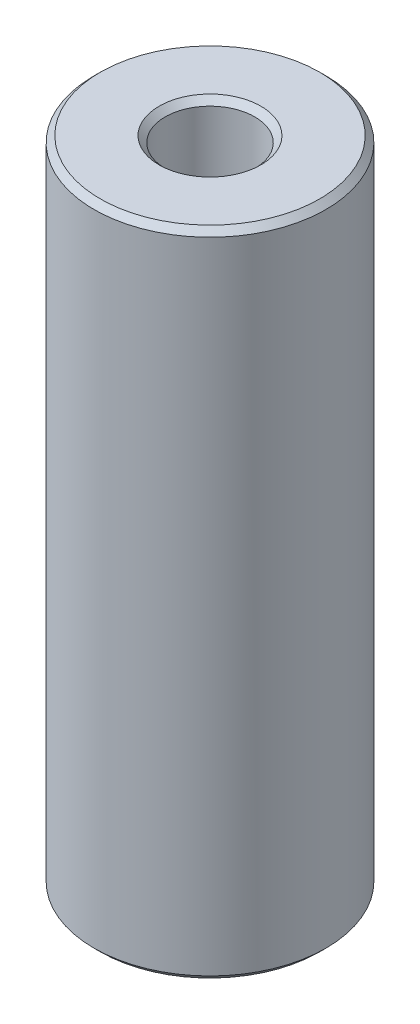
ISO-10303-21;
HEADER;
FILE_DESCRIPTION(('STEP AP214'),'2;1');
FILE_NAME('part.step','',(''),(''),'','','');
FILE_SCHEMA(('AUTOMOTIVE_DESIGN { 1 0 10303 214 1 1 1 1 }'));
ENDSEC;
DATA;
#1=APPLICATION_CONTEXT('core data for automotive mechanical design processes');
#2=APPLICATION_PROTOCOL_DEFINITION('international standard','automotive_design',2000,#1);
#3=PRODUCT_CONTEXT('',#1,'mechanical');
#4=PRODUCT('Part','Part','',(#3));
#5=PRODUCT_RELATED_PRODUCT_CATEGORY('part','',(#4));
#6=PRODUCT_DEFINITION_FORMATION('','',#4);
#7=PRODUCT_DEFINITION_CONTEXT('part definition',#1,'design');
#8=PRODUCT_DEFINITION('design','',#6,#7);
#9=PRODUCT_DEFINITION_SHAPE('','',#8);
#10=(LENGTH_UNIT() NAMED_UNIT(*) SI_UNIT(.MILLI.,.METRE.));
#11=(NAMED_UNIT(*) PLANE_ANGLE_UNIT() SI_UNIT($,.RADIAN.));
#12=(NAMED_UNIT(*) SI_UNIT($,.STERADIAN.) SOLID_ANGLE_UNIT());
#13=UNCERTAINTY_MEASURE_WITH_UNIT(LENGTH_MEASURE(1.E-05),#10,'distance_accuracy_value','');
#14=(GEOMETRIC_REPRESENTATION_CONTEXT(3) GLOBAL_UNCERTAINTY_ASSIGNED_CONTEXT((#13)) GLOBAL_UNIT_ASSIGNED_CONTEXT((#10,
#11,#12)) REPRESENTATION_CONTEXT('',''));
#15=CARTESIAN_POINT('',(0.,0.,0.));
#16=DIRECTION('',(0.,0.,1.));
#17=DIRECTION('',(1.,0.,0.));
#18=AXIS2_PLACEMENT_3D('',#15,#16,#17);
#19=CARTESIAN_POINT('',(0.,309.418122975093,0.));
#20=DIRECTION('',(0.,-1.,0.));
#21=DIRECTION('',(0.,0.,-1.));
#22=AXIS2_PLACEMENT_3D('',#19,#20,#21);
#23=CYLINDRICAL_SURFACE('',#22,55.);
#24=CARTESIAN_POINT('',(0.,2.9195586631775,0.));
#25=DIRECTION('',(0.,1.,0.));
#26=DIRECTION('',(0.,0.,1.));
#27=AXIS2_PLACEMENT_3D('',#24,#25,#26);
#28=CIRCLE('',#27,55.);
#29=CARTESIAN_POINT('',(0.,2.9195586631775,55.));
#30=VERTEX_POINT('',#29);
#31=EDGE_CURVE('E10',#30,#30,#28,.T.);
#32=ORIENTED_EDGE('',*,*,#31,.T.);
#33=EDGE_LOOP('',(#32));
#34=FACE_BOUND('',#33,.T.);
#35=CARTESIAN_POINT('',(0.,306.498564311915,0.));
#36=DIRECTION('',(0.,1.,0.));
#37=DIRECTION('',(0.,0.,1.));
#38=AXIS2_PLACEMENT_3D('',#35,#36,#37);
#39=CIRCLE('',#38,55.);
#40=CARTESIAN_POINT('',(0.,306.498564311915,-55.));
#41=VERTEX_POINT('',#40);
#42=EDGE_CURVE('E50',#41,#41,#39,.F.);
#43=ORIENTED_EDGE('',*,*,#42,.T.);
#44=EDGE_LOOP('',(#43));
#45=FACE_BOUND('',#44,.T.);
#46=ADVANCED_FACE('F39',(#34,#45),#23,.T.);
#47=CARTESIAN_POINT('',(0.,309.418122975093,0.));
#48=DIRECTION('',(0.,1.,0.));
#49=DIRECTION('',(0.,0.,1.));
#50=AXIS2_PLACEMENT_3D('',#47,#48,#49);
#51=PLANE('',#50);
#52=CARTESIAN_POINT('',(0.,309.418122975093,0.));
#53=DIRECTION('',(0.,1.,0.));
#54=DIRECTION('',(0.,0.,1.));
#55=AXIS2_PLACEMENT_3D('',#52,#53,#54);
#56=CIRCLE('',#55,24.1555903856508);
#57=CARTESIAN_POINT('',(0.,309.418122975093,24.1555903856508));
#58=VERTEX_POINT('',#57);
#59=EDGE_CURVE('E58',#58,#58,#56,.F.);
#60=ORIENTED_EDGE('',*,*,#59,.T.);
#61=EDGE_LOOP('',(#60));
#62=FACE_BOUND('',#61,.T.);
#63=CARTESIAN_POINT('',(0.,309.418122975093,0.));
#64=DIRECTION('',(0.,1.,0.));
#65=DIRECTION('',(0.,0.,1.));
#66=AXIS2_PLACEMENT_3D('',#63,#64,#65);
#67=CIRCLE('',#66,52.0804413368224);
#68=CARTESIAN_POINT('',(0.,309.418122975093,-52.0804413368225));
#69=VERTEX_POINT('',#68);
#70=EDGE_CURVE('E61',#69,#69,#67,.T.);
#71=ORIENTED_EDGE('',*,*,#70,.T.);
#72=EDGE_LOOP('',(#71));
#73=FACE_BOUND('',#72,.T.);
#74=ADVANCED_FACE('F88',(#62,#73),#51,.T.);
#75=CARTESIAN_POINT('',(0.,0.,0.));
#76=DIRECTION('',(0.,1.,0.));
#77=DIRECTION('',(0.,0.,1.));
#78=AXIS2_PLACEMENT_3D('',#75,#76,#77);
#79=PLANE('',#78);
#80=CARTESIAN_POINT('',(0.,0.,0.));
#81=DIRECTION('',(0.,1.,0.));
#82=DIRECTION('',(0.,0.,1.));
#83=AXIS2_PLACEMENT_3D('',#80,#81,#82);
#84=CIRCLE('',#83,24.155590385651);
#85=CARTESIAN_POINT('',(0.,0.,24.155590385651));
#86=VERTEX_POINT('',#85);
#87=EDGE_CURVE('E51',#86,#86,#84,.T.);
#88=ORIENTED_EDGE('',*,*,#87,.T.);
#89=EDGE_LOOP('',(#88));
#90=FACE_BOUND('',#89,.T.);
#91=CARTESIAN_POINT('',(0.,0.,0.));
#92=DIRECTION('',(0.,1.,0.));
#93=DIRECTION('',(0.,0.,1.));
#94=AXIS2_PLACEMENT_3D('',#91,#92,#93);
#95=CIRCLE('',#94,52.0804413368225);
#96=CARTESIAN_POINT('',(0.,0.,52.0804413368225));
#97=VERTEX_POINT('',#96);
#98=EDGE_CURVE('E54',#97,#97,#95,.F.);
#99=ORIENTED_EDGE('',*,*,#98,.T.);
#100=EDGE_LOOP('',(#99));
#101=FACE_BOUND('',#100,.T.);
#102=ADVANCED_FACE('F83',(#90,#101),#79,.F.);
#103=CARTESIAN_POINT('',(0.,309.418122975093,0.));
#104=DIRECTION('',(0.,-1.,0.));
#105=DIRECTION('',(0.,0.,-1.));
#106=AXIS2_PLACEMENT_3D('',#103,#104,#105);
#107=CYLINDRICAL_SURFACE('',#106,21.2360317224734);
#108=CARTESIAN_POINT('',(0.,306.498564311916,0.));
#109=DIRECTION('',(0.,1.,0.));
#110=DIRECTION('',(0.,0.,1.));
#111=AXIS2_PLACEMENT_3D('',#108,#109,#110);
#112=CIRCLE('',#111,21.2360317224734);
#113=CARTESIAN_POINT('',(0.,306.498564311916,21.2360317224734));
#114=VERTEX_POINT('',#113);
#115=EDGE_CURVE('E67',#114,#114,#112,.T.);
#116=ORIENTED_EDGE('',*,*,#115,.T.);
#117=EDGE_LOOP('',(#116));
#118=FACE_BOUND('',#117,.T.);
#119=CARTESIAN_POINT('',(0.,2.91955866317767,0.));
#120=DIRECTION('',(0.,1.,0.));
#121=DIRECTION('',(0.,0.,1.));
#122=AXIS2_PLACEMENT_3D('',#119,#120,#121);
#123=CIRCLE('',#122,21.2360317224734);
#124=CARTESIAN_POINT('',(0.,2.91955866317767,21.2360317224734));
#125=VERTEX_POINT('',#124);
#126=EDGE_CURVE('E69',#125,#125,#123,.F.);
#127=ORIENTED_EDGE('',*,*,#126,.T.);
#128=EDGE_LOOP('',(#127));
#129=FACE_BOUND('',#128,.T.);
#130=ADVANCED_FACE('F71',(#118,#129),#107,.F.);
#131=CARTESIAN_POINT('',(0.,306.498564311916,0.));
#132=DIRECTION('',(0.,1.,0.));
#133=DIRECTION('',(0.,0.,1.));
#134=AXIS2_PLACEMENT_3D('',#131,#132,#133);
#135=CONICAL_SURFACE('',#134,21.2360317224734,0.785398163397443);
#136=ORIENTED_EDGE('',*,*,#59,.F.);
#137=EDGE_LOOP('',(#136));
#138=FACE_BOUND('',#137,.T.);
#139=ORIENTED_EDGE('',*,*,#115,.F.);
#140=EDGE_LOOP('',(#139));
#141=FACE_BOUND('',#140,.T.);
#142=ADVANCED_FACE('F77',(#138,#141),#135,.F.);
#143=CARTESIAN_POINT('',(0.,0.,0.));
#144=DIRECTION('',(0.,-1.,0.));
#145=DIRECTION('',(0.,0.,-1.));
#146=AXIS2_PLACEMENT_3D('',#143,#144,#145);
#147=CONICAL_SURFACE('',#146,24.155590385651,0.785398163397443);
#148=ORIENTED_EDGE('',*,*,#126,.F.);
#149=EDGE_LOOP('',(#148));
#150=FACE_BOUND('',#149,.T.);
#151=ORIENTED_EDGE('',*,*,#87,.F.);
#152=EDGE_LOOP('',(#151));
#153=FACE_BOUND('',#152,.T.);
#154=ADVANCED_FACE('F73',(#150,#153),#147,.F.);
#155=CARTESIAN_POINT('',(0.,2.9195586631775,0.));
#156=DIRECTION('',(0.,1.,0.));
#157=DIRECTION('',(0.,0.,1.));
#158=AXIS2_PLACEMENT_3D('',#155,#156,#157);
#159=CONICAL_SURFACE('',#158,55.,0.785398163397454);
#160=ORIENTED_EDGE('',*,*,#98,.F.);
#161=EDGE_LOOP('',(#160));
#162=FACE_BOUND('',#161,.T.);
#163=ORIENTED_EDGE('',*,*,#31,.F.);
#164=EDGE_LOOP('',(#163));
#165=FACE_BOUND('',#164,.T.);
#166=ADVANCED_FACE('F76',(#162,#165),#159,.T.);
#167=CARTESIAN_POINT('',(0.,309.418122975093,0.));
#168=DIRECTION('',(0.,-1.,0.));
#169=DIRECTION('',(0.,0.,-1.));
#170=AXIS2_PLACEMENT_3D('',#167,#168,#169);
#171=CONICAL_SURFACE('',#170,52.0804413368224,0.78539816339744);
#172=CARTESIAN_POINT('',(0.,306.498564311915,-55.));
#173=CARTESIAN_POINT('',(0.,306.528976381324,-54.9695879305919));
#174=CARTESIAN_POINT('',(0.,306.559388450732,-54.9391758611838));
#175=CARTESIAN_POINT('',(0.,306.620212589548,-54.8783517223676));
#176=CARTESIAN_POINT('',(0.,306.650624658956,-54.8479396529595));
#177=CARTESIAN_POINT('',(0.,306.711448797772,-54.7871155141433));
#178=CARTESIAN_POINT('',(0.,306.74186086718,-54.7567034447352));
#179=CARTESIAN_POINT('',(0.,306.802685005996,-54.695879305919));
#180=CARTESIAN_POINT('',(0.,306.833097075405,-54.6654672365109));
#181=CARTESIAN_POINT('',(0.,306.893921214221,-54.6046430976947));
#182=CARTESIAN_POINT('',(0.,306.924333283629,-54.5742310282866));
#183=CARTESIAN_POINT('',(0.,306.985157422445,-54.5134068894704));
#184=CARTESIAN_POINT('',(0.,307.015569491853,-54.4829948200623));
#185=CARTESIAN_POINT('',(0.,307.076393630669,-54.4221706812461));
#186=CARTESIAN_POINT('',(0.,307.106805700077,-54.391758611838));
#187=CARTESIAN_POINT('',(0.,307.167629838894,-54.3309344730218));
#188=CARTESIAN_POINT('',(0.,307.198041908302,-54.3005224036137));
#189=CARTESIAN_POINT('',(0.,307.258866047118,-54.2396982647975));
#190=CARTESIAN_POINT('',(0.,307.289278116526,-54.2092861953894));
#191=CARTESIAN_POINT('',(0.,307.350102255342,-54.1484620565732));
#192=CARTESIAN_POINT('',(0.,307.38051432475,-54.1180499871651));
#193=CARTESIAN_POINT('',(0.,307.441338463567,-54.0572258483489));
#194=CARTESIAN_POINT('',(0.,307.471750532975,-54.0268137789408));
#195=CARTESIAN_POINT('',(0.,307.532574671791,-53.9659896401246));
#196=CARTESIAN_POINT('',(0.,307.562986741199,-53.9355775707165));
#197=CARTESIAN_POINT('',(0.,307.623810880015,-53.8747534319003));
#198=CARTESIAN_POINT('',(0.,307.654222949423,-53.8443413624923));
#199=CARTESIAN_POINT('',(0.,307.715047088239,-53.783517223676));
#200=CARTESIAN_POINT('',(0.,307.745459157648,-53.7531051542679));
#201=CARTESIAN_POINT('',(0.,307.806283296464,-53.6922810154517));
#202=CARTESIAN_POINT('',(0.,307.836695365872,-53.6618689460436));
#203=CARTESIAN_POINT('',(0.,307.897519504688,-53.6010448072275));
#204=CARTESIAN_POINT('',(0.,307.927931574096,-53.5706327378193));
#205=CARTESIAN_POINT('',(0.,307.988755712912,-53.5098085990031));
#206=CARTESIAN_POINT('',(0.,308.01916778232,-53.479396529595));
#207=CARTESIAN_POINT('',(0.,308.079991921137,-53.4185723907788));
#208=CARTESIAN_POINT('',(0.,308.110403990545,-53.3881603213708));
#209=CARTESIAN_POINT('',(0.,308.171228129361,-53.3273361825546));
#210=CARTESIAN_POINT('',(0.,308.201640198769,-53.2969241131464));
#211=CARTESIAN_POINT('',(0.,308.262464337585,-53.2360999743302));
#212=CARTESIAN_POINT('',(0.,308.292876406993,-53.2056879049221));
#213=CARTESIAN_POINT('',(0.,308.35370054581,-53.1448637661059));
#214=CARTESIAN_POINT('',(0.,308.384112615218,-53.1144516966979));
#215=CARTESIAN_POINT('',(0.,308.444936754034,-53.0536275578817));
#216=CARTESIAN_POINT('',(0.,308.475348823442,-53.0232154884736));
#217=CARTESIAN_POINT('',(0.,308.536172962258,-52.9623913496574));
#218=CARTESIAN_POINT('',(0.,308.566585031666,-52.9319792802493));
#219=CARTESIAN_POINT('',(0.,308.627409170483,-52.8711551414331));
#220=CARTESIAN_POINT('',(0.,308.657821239891,-52.840743072025));
#221=CARTESIAN_POINT('',(0.,308.718645378707,-52.7799189332088));
#222=CARTESIAN_POINT('',(0.,308.749057448115,-52.7495068638006));
#223=CARTESIAN_POINT('',(0.,308.809881586931,-52.6886827249844));
#224=CARTESIAN_POINT('',(0.,308.840293656339,-52.6582706555764));
#225=CARTESIAN_POINT('',(0.,308.901117795155,-52.5974465167602));
#226=CARTESIAN_POINT('',(0.,308.931529864563,-52.5670344473521));
#227=CARTESIAN_POINT('',(0.,308.99235400338,-52.5062103085359));
#228=CARTESIAN_POINT('',(0.,309.022766072788,-52.4757982391278));
#229=CARTESIAN_POINT('',(0.,309.083590211604,-52.4149741003116));
#230=CARTESIAN_POINT('',(0.,309.114002281012,-52.3845620309035));
#231=CARTESIAN_POINT('',(0.,309.174826419828,-52.3237378920873));
#232=CARTESIAN_POINT('',(0.,309.205238489236,-52.2933258226792));
#233=CARTESIAN_POINT('',(0.,309.266062628053,-52.232501683863));
#234=CARTESIAN_POINT('',(0.,309.296474697461,-52.2020896144549));
#235=CARTESIAN_POINT('',(0.,309.357298836277,-52.1412654756387));
#236=CARTESIAN_POINT('',(0.,309.387710905685,-52.1108534062306));
#237=CARTESIAN_POINT('',(0.,309.418122975093,-52.0804413368225));
#238=B_SPLINE_CURVE_WITH_KNOTS('',3,(#172,#173,#174,#175,#176,#177,#178,#179,#180,#181,#182,
#183,#184,#185,#186,#187,#188,#189,#190,#191,#192,#193,#194,#195,#196,#197,#198,#199,#200,#201,
#202,#203,#204,#205,#206,#207,#208,#209,#210,#211,#212,#213,#214,#215,#216,#217,#218,#219,#220,
#221,#222,#223,#224,#225,#226,#227,#228,#229,#230,#231,#232,#233,#234,#235,#236,#237),
.UNSPECIFIED.,.F.,.F.,(4,2,2,2,2,2,2,2,2,2,2,2,2,2,2,2,2,2,2,2,2,2,2,2,2,2,2,2,2,2,2,2,4),(0.,
0.129027483050316,0.258054966100627,0.387082449150904,0.51610993220122,0.645137415251536,
0.774164898301813,0.903192381352124,1.0322198644024,1.16124734745272,1.29027483050303,
1.41930231355331,1.54832979660362,1.67735727965394,1.80638476270421,1.93541224575453,
2.0644397288048,2.19346721185512,2.32249469490543,2.45152217795571,2.58054966100603,
2.70957714405634,2.83860462710661,2.96763211015693,3.09665959320725,3.22568707625752,
3.35471455930783,3.48374204235811,3.61276952540843,3.74179700845874,3.87082449150902,
3.99985197455933,4.12887945760965),.UNSPECIFIED.);
#239=EDGE_CURVE('BSEAM45',#41,#69,#238,.T.);
#240=ORIENTED_EDGE('',*,*,#42,.F.);
#241=ORIENTED_EDGE('',*,*,#70,.F.);
#242=ORIENTED_EDGE('',*,*,#239,.T.);
#243=ORIENTED_EDGE('',*,*,#239,.F.);
#244=EDGE_LOOP('',(#240,#242,#241,#243));
#245=FACE_BOUND('',#244,.T.);
#246=ADVANCED_FACE('F45',(#245),#171,.T.);
#247=CLOSED_SHELL('',(#46,#74,#102,#130,#142,#154,#166,#246));
#248=MANIFOLD_SOLID_BREP('B2',#247);
#249=ADVANCED_BREP_SHAPE_REPRESENTATION('',(#18,#248),#14);
#250=SHAPE_DEFINITION_REPRESENTATION(#9,#249);
ENDSEC;
END-ISO-10303-21;
